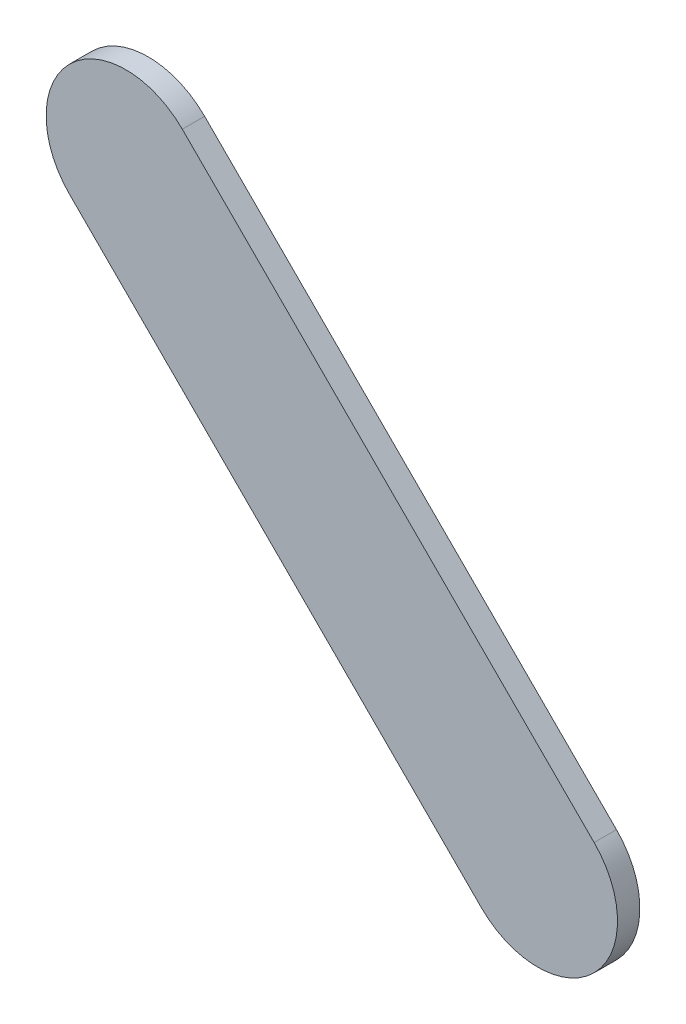
ISO-10303-21;
HEADER;
FILE_DESCRIPTION(('STEP AP214'),'2;1');
FILE_NAME('part.step','',(''),(''),'','','');
FILE_SCHEMA(('AUTOMOTIVE_DESIGN { 1 0 10303 214 1 1 1 1 }'));
ENDSEC;
DATA;
#1=APPLICATION_CONTEXT('core data for automotive mechanical design processes');
#2=APPLICATION_PROTOCOL_DEFINITION('international standard','automotive_design',2000,#1);
#3=PRODUCT_CONTEXT('',#1,'mechanical');
#4=PRODUCT('Part','Part','',(#3));
#5=PRODUCT_RELATED_PRODUCT_CATEGORY('part','',(#4));
#6=PRODUCT_DEFINITION_FORMATION('','',#4);
#7=PRODUCT_DEFINITION_CONTEXT('part definition',#1,'design');
#8=PRODUCT_DEFINITION('design','',#6,#7);
#9=PRODUCT_DEFINITION_SHAPE('','',#8);
#10=(LENGTH_UNIT() NAMED_UNIT(*) SI_UNIT(.MILLI.,.METRE.));
#11=(NAMED_UNIT(*) PLANE_ANGLE_UNIT() SI_UNIT($,.RADIAN.));
#12=(NAMED_UNIT(*) SI_UNIT($,.STERADIAN.) SOLID_ANGLE_UNIT());
#13=UNCERTAINTY_MEASURE_WITH_UNIT(LENGTH_MEASURE(1.E-05),#10,'distance_accuracy_value','');
#14=(GEOMETRIC_REPRESENTATION_CONTEXT(3) GLOBAL_UNCERTAINTY_ASSIGNED_CONTEXT((#13)) GLOBAL_UNIT_ASSIGNED_CONTEXT((#10,
#11,#12)) REPRESENTATION_CONTEXT('',''));
#15=CARTESIAN_POINT('',(0.,0.,0.));
#16=DIRECTION('',(0.,0.,1.));
#17=DIRECTION('',(1.,0.,0.));
#18=AXIS2_PLACEMENT_3D('',#15,#16,#17);
#19=CARTESIAN_POINT('',(84.92717076,71.84595994,0.));
#20=DIRECTION('',(0.707106781186548,0.707106781186548,0.));
#21=DIRECTION('',(0.707106781186548,-0.707106781186548,0.));
#22=AXIS2_PLACEMENT_3D('',#19,#20,#21);
#23=PLANE('',#22);
#24=DIRECTION('',(0.707106781186548,-0.707106781186548,0.));
#25=VECTOR('',#24,1.);
#26=CARTESIAN_POINT('',(84.92717076,71.84595994,0.03556));
#27=LINE('',#26,#25);
#28=CARTESIAN_POINT('',(84.92717076,71.84595994,0.03556));
#29=VERTEX_POINT('',#28);
#30=CARTESIAN_POINT('',(85.58296066,71.19017004,0.03556));
#31=VERTEX_POINT('',#30);
#32=EDGE_CURVE('E11',#29,#31,#27,.T.);
#33=ORIENTED_EDGE('',*,*,#32,.F.);
#34=DIRECTION('',(0.,0.,1.));
#35=VECTOR('',#34,1.);
#36=CARTESIAN_POINT('',(84.92717076,71.84595994,0.));
#37=LINE('',#36,#35);
#38=CARTESIAN_POINT('',(84.92717076,71.84595994,0.));
#39=VERTEX_POINT('',#38);
#40=EDGE_CURVE('E24',#39,#29,#37,.T.);
#41=ORIENTED_EDGE('',*,*,#40,.F.);
#42=DIRECTION('',(0.707106781186548,-0.707106781186548,0.));
#43=VECTOR('',#42,1.);
#44=CARTESIAN_POINT('',(84.92717076,71.84595994,0.));
#45=LINE('',#44,#43);
#46=CARTESIAN_POINT('',(85.58296066,71.19017004,0.));
#47=VERTEX_POINT('',#46);
#48=EDGE_CURVE('E75',#39,#47,#45,.T.);
#49=ORIENTED_EDGE('',*,*,#48,.T.);
#50=DIRECTION('',(0.,0.,1.));
#51=VECTOR('',#50,1.);
#52=CARTESIAN_POINT('',(85.58296066,71.19017004,0.));
#53=LINE('',#52,#51);
#54=EDGE_CURVE('E37',#47,#31,#53,.T.);
#55=ORIENTED_EDGE('',*,*,#54,.T.);
#56=EDGE_LOOP('',(#33,#41,#49,#55));
#57=FACE_BOUND('',#56,.T.);
#58=ADVANCED_FACE('F17',(#57),#23,.F.);
#59=CARTESIAN_POINT('',(85.67276236,71.27997301,0.));
#60=DIRECTION('',(0.,0.,-1.));
#61=DIRECTION('',(-0.707101781156281,-0.707111781181459,0.));
#62=AXIS2_PLACEMENT_3D('',#59,#60,#61);
#63=CYLINDRICAL_SURFACE('',#62,0.126999680092943);
#64=CARTESIAN_POINT('',(85.67276236,71.27997301,0.03556));
#65=DIRECTION('',(0.,0.,1.));
#66=DIRECTION('',(-0.707101781156281,-0.707111781181459,0.));
#67=AXIS2_PLACEMENT_3D('',#64,#65,#66);
#68=CIRCLE('',#67,0.126999680092943);
#69=CARTESIAN_POINT('',(85.76256406,71.36977598,0.03556));
#70=VERTEX_POINT('',#69);
#71=EDGE_CURVE('E83',#31,#70,#68,.T.);
#72=ORIENTED_EDGE('',*,*,#71,.F.);
#73=ORIENTED_EDGE('',*,*,#54,.F.);
#74=CARTESIAN_POINT('',(85.67276236,71.27997301,0.));
#75=DIRECTION('',(0.,0.,1.));
#76=DIRECTION('',(-0.707101781156281,-0.707111781181459,0.));
#77=AXIS2_PLACEMENT_3D('',#74,#75,#76);
#78=CIRCLE('',#77,0.126999680092943);
#79=CARTESIAN_POINT('',(85.76256406,71.36977598,0.));
#80=VERTEX_POINT('',#79);
#81=EDGE_CURVE('E81',#47,#80,#78,.T.);
#82=ORIENTED_EDGE('',*,*,#81,.T.);
#83=DIRECTION('',(0.,0.,1.));
#84=VECTOR('',#83,1.);
#85=CARTESIAN_POINT('',(85.76256406,71.36977598,0.));
#86=LINE('',#85,#84);
#87=EDGE_CURVE('E67',#80,#70,#86,.T.);
#88=ORIENTED_EDGE('',*,*,#87,.T.);
#89=EDGE_LOOP('',(#72,#73,#82,#88));
#90=FACE_BOUND('',#89,.T.);
#91=ADVANCED_FACE('F89',(#90),#63,.T.);
#92=CARTESIAN_POINT('',(85.76256406,71.36977598,0.));
#93=DIRECTION('',(-0.707106781186548,-0.707106781186548,0.));
#94=DIRECTION('',(-0.707106781186548,0.707106781186548,0.));
#95=AXIS2_PLACEMENT_3D('',#92,#93,#94);
#96=PLANE('',#95);
#97=DIRECTION('',(-0.707106781186548,0.707106781186548,0.));
#98=VECTOR('',#97,1.);
#99=CARTESIAN_POINT('',(85.76256406,71.36977598,0.03556));
#100=LINE('',#99,#98);
#101=CARTESIAN_POINT('',(85.1067767,72.02556334,0.03556));
#102=VERTEX_POINT('',#101);
#103=EDGE_CURVE('E71',#70,#102,#100,.T.);
#104=ORIENTED_EDGE('',*,*,#103,.F.);
#105=ORIENTED_EDGE('',*,*,#87,.F.);
#106=DIRECTION('',(-0.707106781186548,0.707106781186548,0.));
#107=VECTOR('',#106,1.);
#108=CARTESIAN_POINT('',(85.76256406,71.36977598,0.));
#109=LINE('',#108,#107);
#110=CARTESIAN_POINT('',(85.1067767,72.02556334,0.));
#111=VERTEX_POINT('',#110);
#112=EDGE_CURVE('E63',#80,#111,#109,.T.);
#113=ORIENTED_EDGE('',*,*,#112,.T.);
#114=DIRECTION('',(0.,0.,1.));
#115=VECTOR('',#114,1.);
#116=CARTESIAN_POINT('',(85.1067767,72.02556334,0.));
#117=LINE('',#116,#115);
#118=EDGE_CURVE('E53',#111,#102,#117,.T.);
#119=ORIENTED_EDGE('',*,*,#118,.T.);
#120=EDGE_LOOP('',(#104,#105,#113,#119));
#121=FACE_BOUND('',#120,.T.);
#122=ADVANCED_FACE('F66',(#121),#96,.F.);
#123=CARTESIAN_POINT('',(85.01697373,71.93576164,0.));
#124=DIRECTION('',(0.,0.,-1.));
#125=DIRECTION('',(0.707111781181515,0.707101781156225,0.));
#126=AXIS2_PLACEMENT_3D('',#123,#124,#125);
#127=CYLINDRICAL_SURFACE('',#126,0.126999680092943);
#128=CARTESIAN_POINT('',(85.01697373,71.93576164,0.03556));
#129=DIRECTION('',(0.,0.,1.));
#130=DIRECTION('',(0.707111781181515,0.707101781156225,0.));
#131=AXIS2_PLACEMENT_3D('',#128,#129,#130);
#132=CIRCLE('',#131,0.126999680092943);
#133=EDGE_CURVE('E59',#102,#29,#132,.T.);
#134=ORIENTED_EDGE('',*,*,#133,.F.);
#135=ORIENTED_EDGE('',*,*,#118,.F.);
#136=CARTESIAN_POINT('',(85.01697373,71.93576164,0.));
#137=DIRECTION('',(0.,0.,1.));
#138=DIRECTION('',(0.707111781181515,0.707101781156225,0.));
#139=AXIS2_PLACEMENT_3D('',#136,#137,#138);
#140=CIRCLE('',#139,0.126999680092943);
#141=EDGE_CURVE('E57',#111,#39,#140,.T.);
#142=ORIENTED_EDGE('',*,*,#141,.T.);
#143=ORIENTED_EDGE('',*,*,#40,.T.);
#144=EDGE_LOOP('',(#134,#135,#142,#143));
#145=FACE_BOUND('',#144,.T.);
#146=ADVANCED_FACE('F55',(#145),#127,.T.);
#147=CARTESIAN_POINT('',(84.92717076,71.84595994,0.));
#148=DIRECTION('',(0.,0.,-1.));
#149=DIRECTION('',(-1.,0.,0.));
#150=AXIS2_PLACEMENT_3D('',#147,#148,#149);
#151=PLANE('',#150);
#152=ORIENTED_EDGE('',*,*,#141,.F.);
#153=ORIENTED_EDGE('',*,*,#112,.F.);
#154=ORIENTED_EDGE('',*,*,#81,.F.);
#155=ORIENTED_EDGE('',*,*,#48,.F.);
#156=EDGE_LOOP('',(#152,#153,#154,#155));
#157=FACE_BOUND('',#156,.T.);
#158=ADVANCED_FACE('F74',(#157),#151,.T.);
#159=CARTESIAN_POINT('',(84.92717076,71.84595994,0.03556));
#160=DIRECTION('',(0.,0.,-1.));
#161=DIRECTION('',(-1.,0.,0.));
#162=AXIS2_PLACEMENT_3D('',#159,#160,#161);
#163=PLANE('',#162);
#164=ORIENTED_EDGE('',*,*,#32,.T.);
#165=ORIENTED_EDGE('',*,*,#71,.T.);
#166=ORIENTED_EDGE('',*,*,#103,.T.);
#167=ORIENTED_EDGE('',*,*,#133,.T.);
#168=EDGE_LOOP('',(#164,#165,#166,#167));
#169=FACE_BOUND('',#168,.T.);
#170=ADVANCED_FACE('F91',(#169),#163,.F.);
#171=CLOSED_SHELL('',(#58,#91,#122,#146,#158,#170));
#172=MANIFOLD_SOLID_BREP('B1',#171);
#173=ADVANCED_BREP_SHAPE_REPRESENTATION('',(#18,#172),#14);
#174=SHAPE_DEFINITION_REPRESENTATION(#9,#173);
ENDSEC;
END-ISO-10303-21;
